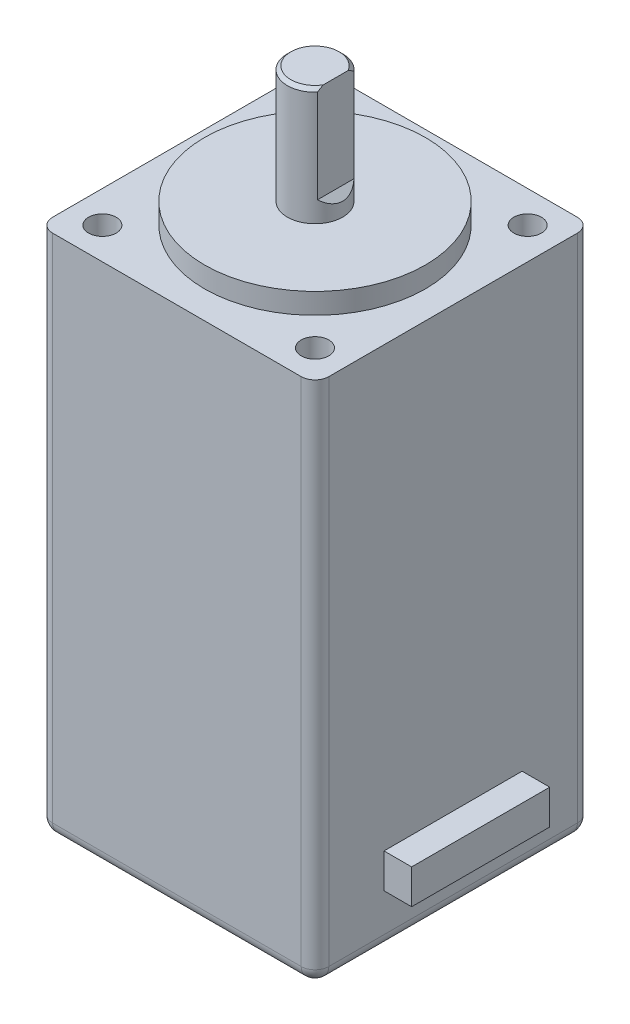
ISO-10303-21;
HEADER;
FILE_DESCRIPTION(('STEP AP214'),'2;1');
FILE_NAME('part.step','',(''),(''),'','','');
FILE_SCHEMA(('AUTOMOTIVE_DESIGN { 1 0 10303 214 1 1 1 1 }'));
ENDSEC;
DATA;
#1=APPLICATION_CONTEXT('core data for automotive mechanical design processes');
#2=APPLICATION_PROTOCOL_DEFINITION('international standard','automotive_design',2000,#1);
#3=PRODUCT_CONTEXT('',#1,'mechanical');
#4=PRODUCT('Part','Part','',(#3));
#5=PRODUCT_RELATED_PRODUCT_CATEGORY('part','',(#4));
#6=PRODUCT_DEFINITION_FORMATION('','',#4);
#7=PRODUCT_DEFINITION_CONTEXT('part definition',#1,'design');
#8=PRODUCT_DEFINITION('design','',#6,#7);
#9=PRODUCT_DEFINITION_SHAPE('','',#8);
#10=(LENGTH_UNIT() NAMED_UNIT(*) SI_UNIT(.MILLI.,.METRE.));
#11=(NAMED_UNIT(*) PLANE_ANGLE_UNIT() SI_UNIT($,.RADIAN.));
#12=(NAMED_UNIT(*) SI_UNIT($,.STERADIAN.) SOLID_ANGLE_UNIT());
#13=UNCERTAINTY_MEASURE_WITH_UNIT(LENGTH_MEASURE(1.E-05),#10,'distance_accuracy_value','');
#14=(GEOMETRIC_REPRESENTATION_CONTEXT(3) GLOBAL_UNCERTAINTY_ASSIGNED_CONTEXT((#13)) GLOBAL_UNIT_ASSIGNED_CONTEXT((#10,
#11,#12)) REPRESENTATION_CONTEXT('',''));
#15=CARTESIAN_POINT('',(0.,0.,0.));
#16=DIRECTION('',(0.,0.,1.));
#17=DIRECTION('',(1.,0.,0.));
#18=AXIS2_PLACEMENT_3D('',#15,#16,#17);
#19=CARTESIAN_POINT('',(9.99999999999998,-38.,9.99999999999995));
#20=DIRECTION('',(1.,0.,0.));
#21=DIRECTION('',(0.,0.,-1.));
#22=AXIS2_PLACEMENT_3D('',#19,#20,#21);
#23=PLANE('',#22);
#24=DIRECTION('',(0.,0.,-1.));
#25=VECTOR('',#24,1.);
#26=CARTESIAN_POINT('',(10.,-37.,-10.));
#27=LINE('',#26,#25);
#28=CARTESIAN_POINT('',(9.99999999999999,-37.,8.99999999999995));
#29=VERTEX_POINT('',#28);
#30=CARTESIAN_POINT('',(10.,-37.,-9.00000000000001));
#31=VERTEX_POINT('',#30);
#32=EDGE_CURVE('E747',#29,#31,#27,.T.);
#33=ORIENTED_EDGE('',*,*,#32,.T.);
#34=DIRECTION('',(0.,1.,0.));
#35=VECTOR('',#34,1.);
#36=CARTESIAN_POINT('',(10.,-38.,-9.00000000000001));
#37=LINE('',#36,#35);
#38=CARTESIAN_POINT('',(10.,0.,-9.00000000000001));
#39=VERTEX_POINT('',#38);
#40=EDGE_CURVE('E749',#31,#39,#37,.T.);
#41=ORIENTED_EDGE('',*,*,#40,.T.);
#42=DIRECTION('',(0.,0.,-1.));
#43=VECTOR('',#42,1.);
#44=CARTESIAN_POINT('',(9.99999999999998,0.,9.99999999999995));
#45=LINE('',#44,#43);
#46=CARTESIAN_POINT('',(9.99999999999999,0.,8.99999999999995));
#47=VERTEX_POINT('',#46);
#48=EDGE_CURVE('E236',#47,#39,#45,.T.);
#49=ORIENTED_EDGE('',*,*,#48,.F.);
#50=DIRECTION('',(0.,1.,0.));
#51=VECTOR('',#50,1.);
#52=CARTESIAN_POINT('',(9.99999999999999,-38.,8.99999999999995));
#53=LINE('',#52,#51);
#54=EDGE_CURVE('E745',#47,#29,#53,.F.);
#55=ORIENTED_EDGE('',*,*,#54,.T.);
#56=EDGE_LOOP('',(#33,#41,#49,#55));
#57=FACE_BOUND('',#56,.T.);
#58=DIRECTION('',(0.,0.,1.));
#59=VECTOR('',#58,1.);
#60=CARTESIAN_POINT('',(9.99999999999998,-34.25,9.99999999999995));
#61=LINE('',#60,#59);
#62=CARTESIAN_POINT('',(10.,-34.25,-5.));
#63=VERTEX_POINT('',#62);
#64=CARTESIAN_POINT('',(10.,-34.25,5.));
#65=VERTEX_POINT('',#64);
#66=EDGE_CURVE('E45',#63,#65,#61,.T.);
#67=ORIENTED_EDGE('',*,*,#66,.T.);
#68=DIRECTION('',(0.,1.,0.));
#69=VECTOR('',#68,1.);
#70=CARTESIAN_POINT('',(10.,-38.,5.));
#71=LINE('',#70,#69);
#72=CARTESIAN_POINT('',(10.,-31.75,5.));
#73=VERTEX_POINT('',#72);
#74=EDGE_CURVE('E12',#65,#73,#71,.T.);
#75=ORIENTED_EDGE('',*,*,#74,.T.);
#76=DIRECTION('',(0.,0.,-1.));
#77=VECTOR('',#76,1.);
#78=CARTESIAN_POINT('',(9.99999999999998,-31.75,9.99999999999995));
#79=LINE('',#78,#77);
#80=CARTESIAN_POINT('',(10.,-31.75,-5.));
#81=VERTEX_POINT('',#80);
#82=EDGE_CURVE('E372',#73,#81,#79,.T.);
#83=ORIENTED_EDGE('',*,*,#82,.T.);
#84=DIRECTION('',(0.,-1.,0.));
#85=VECTOR('',#84,1.);
#86=CARTESIAN_POINT('',(10.,-38.,-5.));
#87=LINE('',#86,#85);
#88=EDGE_CURVE('E161',#81,#63,#87,.T.);
#89=ORIENTED_EDGE('',*,*,#88,.T.);
#90=EDGE_LOOP('',(#67,#75,#83,#89));
#91=FACE_BOUND('',#90,.T.);
#92=ADVANCED_FACE('F37',(#57,#91),#23,.T.);
#93=CARTESIAN_POINT('',(-9.99999999999998,-38.,9.99999999999995));
#94=DIRECTION('',(-1.,0.,0.));
#95=DIRECTION('',(0.,0.,1.));
#96=AXIS2_PLACEMENT_3D('',#93,#94,#95);
#97=PLANE('',#96);
#98=DIRECTION('',(0.,0.,1.));
#99=VECTOR('',#98,1.);
#100=CARTESIAN_POINT('',(-9.99999999999998,0.,9.99999999999995));
#101=LINE('',#100,#99);
#102=CARTESIAN_POINT('',(-9.99999999999996,0.,-9.00000000000001));
#103=VERTEX_POINT('',#102);
#104=CARTESIAN_POINT('',(-9.99999999999998,0.,8.99999999999995));
#105=VERTEX_POINT('',#104);
#106=EDGE_CURVE('E228',#103,#105,#101,.T.);
#107=ORIENTED_EDGE('',*,*,#106,.F.);
#108=DIRECTION('',(0.,1.,0.));
#109=VECTOR('',#108,1.);
#110=CARTESIAN_POINT('',(-9.99999999999996,-38.,-9.00000000000001));
#111=LINE('',#110,#109);
#112=CARTESIAN_POINT('',(-9.99999999999996,-37.,-9.00000000000001));
#113=VERTEX_POINT('',#112);
#114=EDGE_CURVE('E60',#103,#113,#111,.F.);
#115=ORIENTED_EDGE('',*,*,#114,.T.);
#116=DIRECTION('',(0.,0.,1.));
#117=VECTOR('',#116,1.);
#118=CARTESIAN_POINT('',(-9.99999999999998,-37.,9.99999999999995));
#119=LINE('',#118,#117);
#120=CARTESIAN_POINT('',(-9.99999999999998,-37.,8.99999999999995));
#121=VERTEX_POINT('',#120);
#122=EDGE_CURVE('E362',#113,#121,#119,.T.);
#123=ORIENTED_EDGE('',*,*,#122,.T.);
#124=DIRECTION('',(0.,1.,0.));
#125=VECTOR('',#124,1.);
#126=CARTESIAN_POINT('',(-9.99999999999998,-38.,8.99999999999995));
#127=LINE('',#126,#125);
#128=EDGE_CURVE('E351',#121,#105,#127,.T.);
#129=ORIENTED_EDGE('',*,*,#128,.T.);
#130=EDGE_LOOP('',(#107,#115,#123,#129));
#131=FACE_BOUND('',#130,.T.);
#132=ADVANCED_FACE('F340',(#131),#97,.T.);
#133=CARTESIAN_POINT('',(10.,-38.,-10.));
#134=DIRECTION('',(0.,0.,-1.));
#135=DIRECTION('',(-1.,0.,0.));
#136=AXIS2_PLACEMENT_3D('',#133,#134,#135);
#137=PLANE('',#136);
#138=DIRECTION('',(-1.,0.,0.));
#139=VECTOR('',#138,1.);
#140=CARTESIAN_POINT('',(-9.99999999999995,-37.,-10.));
#141=LINE('',#140,#139);
#142=CARTESIAN_POINT('',(9.00000000000003,-37.,-10.));
#143=VERTEX_POINT('',#142);
#144=CARTESIAN_POINT('',(-8.99999999999995,-37.,-10.));
#145=VERTEX_POINT('',#144);
#146=EDGE_CURVE('E753',#143,#145,#141,.T.);
#147=ORIENTED_EDGE('',*,*,#146,.T.);
#148=DIRECTION('',(0.,1.,0.));
#149=VECTOR('',#148,1.);
#150=CARTESIAN_POINT('',(-8.99999999999995,-38.,-10.));
#151=LINE('',#150,#149);
#152=CARTESIAN_POINT('',(-8.99999999999995,0.,-10.));
#153=VERTEX_POINT('',#152);
#154=EDGE_CURVE('E755',#145,#153,#151,.T.);
#155=ORIENTED_EDGE('',*,*,#154,.T.);
#156=DIRECTION('',(-1.,0.,0.));
#157=VECTOR('',#156,1.);
#158=CARTESIAN_POINT('',(10.,0.,-10.));
#159=LINE('',#158,#157);
#160=CARTESIAN_POINT('',(9.00000000000003,0.,-10.));
#161=VERTEX_POINT('',#160);
#162=EDGE_CURVE('E239',#161,#153,#159,.T.);
#163=ORIENTED_EDGE('',*,*,#162,.F.);
#164=DIRECTION('',(0.,1.,0.));
#165=VECTOR('',#164,1.);
#166=CARTESIAN_POINT('',(9.00000000000003,-38.,-10.));
#167=LINE('',#166,#165);
#168=EDGE_CURVE('E751',#161,#143,#167,.F.);
#169=ORIENTED_EDGE('',*,*,#168,.T.);
#170=EDGE_LOOP('',(#147,#155,#163,#169));
#171=FACE_BOUND('',#170,.T.);
#172=ADVANCED_FACE('F337',(#171),#137,.T.);
#173=CARTESIAN_POINT('',(9.99999999999998,-38.,9.99999999999995));
#174=DIRECTION('',(0.,0.,1.));
#175=DIRECTION('',(1.,0.,0.));
#176=AXIS2_PLACEMENT_3D('',#173,#174,#175);
#177=PLANE('',#176);
#178=DIRECTION('',(1.,0.,0.));
#179=VECTOR('',#178,1.);
#180=CARTESIAN_POINT('',(9.99999999999998,-37.,9.99999999999995));
#181=LINE('',#180,#179);
#182=CARTESIAN_POINT('',(-8.99999999999998,-37.,9.99999999999995));
#183=VERTEX_POINT('',#182);
#184=CARTESIAN_POINT('',(8.99999999999999,-37.,9.99999999999995));
#185=VERTEX_POINT('',#184);
#186=EDGE_CURVE('E729',#183,#185,#181,.T.);
#187=ORIENTED_EDGE('',*,*,#186,.T.);
#188=DIRECTION('',(0.,1.,0.));
#189=VECTOR('',#188,1.);
#190=CARTESIAN_POINT('',(8.99999999999999,-38.,9.99999999999995));
#191=LINE('',#190,#189);
#192=CARTESIAN_POINT('',(8.99999999999999,0.,9.99999999999995));
#193=VERTEX_POINT('',#192);
#194=EDGE_CURVE('E734',#185,#193,#191,.T.);
#195=ORIENTED_EDGE('',*,*,#194,.T.);
#196=DIRECTION('',(1.,0.,0.));
#197=VECTOR('',#196,1.);
#198=CARTESIAN_POINT('',(9.99999999999998,0.,9.99999999999995));
#199=LINE('',#198,#197);
#200=CARTESIAN_POINT('',(-8.99999999999998,0.,9.99999999999995));
#201=VERTEX_POINT('',#200);
#202=EDGE_CURVE('E233',#201,#193,#199,.T.);
#203=ORIENTED_EDGE('',*,*,#202,.F.);
#204=DIRECTION('',(0.,1.,0.));
#205=VECTOR('',#204,1.);
#206=CARTESIAN_POINT('',(-8.99999999999998,-38.,9.99999999999995));
#207=LINE('',#206,#205);
#208=EDGE_CURVE('E728',#201,#183,#207,.F.);
#209=ORIENTED_EDGE('',*,*,#208,.T.);
#210=EDGE_LOOP('',(#187,#195,#203,#209));
#211=FACE_BOUND('',#210,.T.);
#212=ADVANCED_FACE('F332',(#211),#177,.T.);
#213=CARTESIAN_POINT('',(0.,-38.,0.));
#214=DIRECTION('',(0.,1.,0.));
#215=DIRECTION('',(0.,0.,1.));
#216=AXIS2_PLACEMENT_3D('',#213,#214,#215);
#217=PLANE('',#216);
#218=DIRECTION('',(0.,0.,-1.));
#219=VECTOR('',#218,1.);
#220=CARTESIAN_POINT('',(8.99999999999998,-38.,9.99999999999995));
#221=LINE('',#220,#219);
#222=CARTESIAN_POINT('',(9.00000000000003,-38.,-9.00000000000001));
#223=VERTEX_POINT('',#222);
#224=CARTESIAN_POINT('',(8.99999999999999,-38.,8.99999999999995));
#225=VERTEX_POINT('',#224);
#226=EDGE_CURVE('E740',#223,#225,#221,.F.);
#227=ORIENTED_EDGE('',*,*,#226,.T.);
#228=DIRECTION('',(1.,0.,0.));
#229=VECTOR('',#228,1.);
#230=CARTESIAN_POINT('',(-9.99999999999998,-38.,8.99999999999995));
#231=LINE('',#230,#229);
#232=CARTESIAN_POINT('',(-8.99999999999998,-38.,8.99999999999995));
#233=VERTEX_POINT('',#232);
#234=EDGE_CURVE('E742',#225,#233,#231,.F.);
#235=ORIENTED_EDGE('',*,*,#234,.T.);
#236=DIRECTION('',(0.,0.,1.));
#237=VECTOR('',#236,1.);
#238=CARTESIAN_POINT('',(-8.99999999999995,-38.,-10.));
#239=LINE('',#238,#237);
#240=CARTESIAN_POINT('',(-8.99999999999995,-38.,-9.00000000000001));
#241=VERTEX_POINT('',#240);
#242=EDGE_CURVE('E736',#233,#241,#239,.F.);
#243=ORIENTED_EDGE('',*,*,#242,.T.);
#244=DIRECTION('',(-1.,0.,0.));
#245=VECTOR('',#244,1.);
#246=CARTESIAN_POINT('',(10.,-38.,-9.00000000000001));
#247=LINE('',#246,#245);
#248=EDGE_CURVE('E738',#241,#223,#247,.F.);
#249=ORIENTED_EDGE('',*,*,#248,.T.);
#250=EDGE_LOOP('',(#227,#235,#243,#249));
#251=FACE_BOUND('',#250,.T.);
#252=ADVANCED_FACE('F329',(#251),#217,.F.);
#253=CARTESIAN_POINT('',(0.,0.,0.));
#254=DIRECTION('',(0.,1.,0.));
#255=DIRECTION('',(0.,0.,1.));
#256=AXIS2_PLACEMENT_3D('',#253,#254,#255);
#257=PLANE('',#256);
#258=CARTESIAN_POINT('',(0.,0.,0.));
#259=DIRECTION('',(0.,1.,0.));
#260=DIRECTION('',(0.,0.,1.));
#261=AXIS2_PLACEMENT_3D('',#258,#259,#260);
#262=CIRCLE('',#261,8.);
#263=CARTESIAN_POINT('',(0.,0.,8.));
#264=VERTEX_POINT('',#263);
#265=EDGE_CURVE('E204',#264,#264,#262,.T.);
#266=ORIENTED_EDGE('',*,*,#265,.F.);
#267=EDGE_LOOP('',(#266));
#268=FACE_BOUND('',#267,.T.);
#269=CARTESIAN_POINT('',(-7.7,0.,7.7));
#270=DIRECTION('',(0.,1.,0.));
#271=DIRECTION('',(0.,0.,1.));
#272=AXIS2_PLACEMENT_3D('',#269,#270,#271);
#273=CIRCLE('',#272,1.);
#274=CARTESIAN_POINT('',(-7.7,0.,8.7));
#275=VERTEX_POINT('',#274);
#276=EDGE_CURVE('E203',#275,#275,#273,.T.);
#277=ORIENTED_EDGE('',*,*,#276,.F.);
#278=EDGE_LOOP('',(#277));
#279=FACE_BOUND('',#278,.T.);
#280=CARTESIAN_POINT('',(7.7,0.,7.7));
#281=DIRECTION('',(0.,1.,0.));
#282=DIRECTION('',(0.,0.,1.));
#283=AXIS2_PLACEMENT_3D('',#280,#281,#282);
#284=CIRCLE('',#283,1.);
#285=CARTESIAN_POINT('',(7.7,0.,8.7));
#286=VERTEX_POINT('',#285);
#287=EDGE_CURVE('E217',#286,#286,#284,.T.);
#288=ORIENTED_EDGE('',*,*,#287,.F.);
#289=EDGE_LOOP('',(#288));
#290=FACE_BOUND('',#289,.T.);
#291=CARTESIAN_POINT('',(7.7,0.,-7.7));
#292=DIRECTION('',(0.,1.,0.));
#293=DIRECTION('',(0.,0.,1.));
#294=AXIS2_PLACEMENT_3D('',#291,#292,#293);
#295=CIRCLE('',#294,0.999999999999999);
#296=CARTESIAN_POINT('',(7.7,0.,-6.7));
#297=VERTEX_POINT('',#296);
#298=EDGE_CURVE('E211',#297,#297,#295,.T.);
#299=ORIENTED_EDGE('',*,*,#298,.F.);
#300=EDGE_LOOP('',(#299));
#301=FACE_BOUND('',#300,.T.);
#302=CARTESIAN_POINT('',(-7.7,0.,-7.7));
#303=DIRECTION('',(0.,1.,0.));
#304=DIRECTION('',(0.,0.,1.));
#305=AXIS2_PLACEMENT_3D('',#302,#303,#304);
#306=CIRCLE('',#305,1.);
#307=CARTESIAN_POINT('',(-7.7,0.,-6.7));
#308=VERTEX_POINT('',#307);
#309=EDGE_CURVE('E210',#308,#308,#306,.T.);
#310=ORIENTED_EDGE('',*,*,#309,.F.);
#311=EDGE_LOOP('',(#310));
#312=FACE_BOUND('',#311,.T.);
#313=ORIENTED_EDGE('',*,*,#162,.T.);
#314=CARTESIAN_POINT('',(-8.99999999999995,0.,-9.00000000000001));
#315=DIRECTION('',(0.,1.,0.));
#316=DIRECTION('',(0.,0.,1.));
#317=AXIS2_PLACEMENT_3D('',#314,#315,#316);
#318=CIRCLE('',#317,1.);
#319=EDGE_CURVE('E357',#153,#103,#318,.T.);
#320=ORIENTED_EDGE('',*,*,#319,.T.);
#321=ORIENTED_EDGE('',*,*,#106,.T.);
#322=CARTESIAN_POINT('',(-8.99999999999998,0.,8.99999999999995));
#323=DIRECTION('',(0.,1.,0.));
#324=DIRECTION('',(0.,0.,1.));
#325=AXIS2_PLACEMENT_3D('',#322,#323,#324);
#326=CIRCLE('',#325,1.);
#327=EDGE_CURVE('E361',#105,#201,#326,.T.);
#328=ORIENTED_EDGE('',*,*,#327,.T.);
#329=ORIENTED_EDGE('',*,*,#202,.T.);
#330=CARTESIAN_POINT('',(8.99999999999999,0.,8.99999999999995));
#331=DIRECTION('',(0.,1.,0.));
#332=DIRECTION('',(0.,0.,1.));
#333=AXIS2_PLACEMENT_3D('',#330,#331,#332);
#334=CIRCLE('',#333,1.);
#335=EDGE_CURVE('E364',#193,#47,#334,.T.);
#336=ORIENTED_EDGE('',*,*,#335,.T.);
#337=ORIENTED_EDGE('',*,*,#48,.T.);
#338=CARTESIAN_POINT('',(9.00000000000003,0.,-9.00000000000001));
#339=DIRECTION('',(0.,1.,0.));
#340=DIRECTION('',(0.,0.,1.));
#341=AXIS2_PLACEMENT_3D('',#338,#339,#340);
#342=CIRCLE('',#341,1.);
#343=EDGE_CURVE('E370',#39,#161,#342,.T.);
#344=ORIENTED_EDGE('',*,*,#343,.T.);
#345=EDGE_LOOP('',(#313,#320,#321,#328,#329,#336,#337,#344));
#346=FACE_BOUND('',#345,.T.);
#347=ADVANCED_FACE('F327',(#268,#279,#290,#301,#312,#346),#257,.T.);
#348=CARTESIAN_POINT('',(-7.7,-2.5,-7.7));
#349=DIRECTION('',(0.,1.,0.));
#350=DIRECTION('',(0.,0.,1.));
#351=AXIS2_PLACEMENT_3D('',#348,#349,#350);
#352=CYLINDRICAL_SURFACE('',#351,1.);
#353=CARTESIAN_POINT('',(-7.7,-2.5,-7.7));
#354=DIRECTION('',(0.,1.,0.));
#355=DIRECTION('',(0.,0.,1.));
#356=AXIS2_PLACEMENT_3D('',#353,#354,#355);
#357=CIRCLE('',#356,1.);
#358=CARTESIAN_POINT('',(-7.7,-2.5,-6.7));
#359=VERTEX_POINT('',#358);
#360=EDGE_CURVE('E225',#359,#359,#357,.T.);
#361=ORIENTED_EDGE('',*,*,#360,.F.);
#362=EDGE_LOOP('',(#361));
#363=FACE_BOUND('',#362,.T.);
#364=ORIENTED_EDGE('',*,*,#309,.T.);
#365=EDGE_LOOP('',(#364));
#366=FACE_BOUND('',#365,.T.);
#367=ADVANCED_FACE('F323',(#363,#366),#352,.F.);
#368=CARTESIAN_POINT('',(-7.7,-2.5,-7.7));
#369=DIRECTION('',(0.,1.,0.));
#370=DIRECTION('',(0.,0.,1.));
#371=AXIS2_PLACEMENT_3D('',#368,#369,#370);
#372=PLANE('',#371);
#373=ORIENTED_EDGE('',*,*,#360,.T.);
#374=EDGE_LOOP('',(#373));
#375=FACE_BOUND('',#374,.T.);
#376=ADVANCED_FACE('F305',(#375),#372,.T.);
#377=CARTESIAN_POINT('',(7.7,-2.5,-7.7));
#378=DIRECTION('',(0.,1.,0.));
#379=DIRECTION('',(0.,0.,1.));
#380=AXIS2_PLACEMENT_3D('',#377,#378,#379);
#381=CYLINDRICAL_SURFACE('',#380,0.999999999999999);
#382=CARTESIAN_POINT('',(7.7,-2.5,-7.7));
#383=DIRECTION('',(0.,1.,0.));
#384=DIRECTION('',(0.,0.,1.));
#385=AXIS2_PLACEMENT_3D('',#382,#383,#384);
#386=CIRCLE('',#385,0.999999999999999);
#387=CARTESIAN_POINT('',(7.7,-2.5,-6.7));
#388=VERTEX_POINT('',#387);
#389=EDGE_CURVE('E207',#388,#388,#386,.T.);
#390=ORIENTED_EDGE('',*,*,#389,.F.);
#391=EDGE_LOOP('',(#390));
#392=FACE_BOUND('',#391,.T.);
#393=ORIENTED_EDGE('',*,*,#298,.T.);
#394=EDGE_LOOP('',(#393));
#395=FACE_BOUND('',#394,.T.);
#396=ADVANCED_FACE('F301',(#392,#395),#381,.F.);
#397=CARTESIAN_POINT('',(7.7,-2.5,-7.7));
#398=DIRECTION('',(0.,1.,0.));
#399=DIRECTION('',(0.,0.,1.));
#400=AXIS2_PLACEMENT_3D('',#397,#398,#399);
#401=PLANE('',#400);
#402=ORIENTED_EDGE('',*,*,#389,.T.);
#403=EDGE_LOOP('',(#402));
#404=FACE_BOUND('',#403,.T.);
#405=ADVANCED_FACE('F297',(#404),#401,.T.);
#406=CARTESIAN_POINT('',(7.7,-2.5,7.7));
#407=DIRECTION('',(0.,1.,0.));
#408=DIRECTION('',(0.,0.,1.));
#409=AXIS2_PLACEMENT_3D('',#406,#407,#408);
#410=CYLINDRICAL_SURFACE('',#409,1.);
#411=CARTESIAN_POINT('',(7.7,-2.5,7.7));
#412=DIRECTION('',(0.,1.,0.));
#413=DIRECTION('',(0.,0.,1.));
#414=AXIS2_PLACEMENT_3D('',#411,#412,#413);
#415=CIRCLE('',#414,1.);
#416=CARTESIAN_POINT('',(7.7,-2.5,8.7));
#417=VERTEX_POINT('',#416);
#418=EDGE_CURVE('E214',#417,#417,#415,.T.);
#419=ORIENTED_EDGE('',*,*,#418,.F.);
#420=EDGE_LOOP('',(#419));
#421=FACE_BOUND('',#420,.T.);
#422=ORIENTED_EDGE('',*,*,#287,.T.);
#423=EDGE_LOOP('',(#422));
#424=FACE_BOUND('',#423,.T.);
#425=ADVANCED_FACE('F300',(#421,#424),#410,.F.);
#426=CARTESIAN_POINT('',(7.7,-2.5,7.7));
#427=DIRECTION('',(0.,1.,0.));
#428=DIRECTION('',(0.,0.,1.));
#429=AXIS2_PLACEMENT_3D('',#426,#427,#428);
#430=PLANE('',#429);
#431=ORIENTED_EDGE('',*,*,#418,.T.);
#432=EDGE_LOOP('',(#431));
#433=FACE_BOUND('',#432,.T.);
#434=ADVANCED_FACE('F307',(#433),#430,.T.);
#435=CARTESIAN_POINT('',(-7.7,-2.5,7.7));
#436=DIRECTION('',(0.,1.,0.));
#437=DIRECTION('',(0.,0.,1.));
#438=AXIS2_PLACEMENT_3D('',#435,#436,#437);
#439=CYLINDRICAL_SURFACE('',#438,1.);
#440=CARTESIAN_POINT('',(-7.7,-2.5,7.7));
#441=DIRECTION('',(0.,1.,0.));
#442=DIRECTION('',(0.,0.,1.));
#443=AXIS2_PLACEMENT_3D('',#440,#441,#442);
#444=CIRCLE('',#443,1.);
#445=CARTESIAN_POINT('',(-7.7,-2.5,8.7));
#446=VERTEX_POINT('',#445);
#447=EDGE_CURVE('E220',#446,#446,#444,.T.);
#448=ORIENTED_EDGE('',*,*,#447,.F.);
#449=EDGE_LOOP('',(#448));
#450=FACE_BOUND('',#449,.T.);
#451=ORIENTED_EDGE('',*,*,#276,.T.);
#452=EDGE_LOOP('',(#451));
#453=FACE_BOUND('',#452,.T.);
#454=ADVANCED_FACE('F310',(#450,#453),#439,.F.);
#455=CARTESIAN_POINT('',(-7.7,-2.5,7.7));
#456=DIRECTION('',(0.,1.,0.));
#457=DIRECTION('',(0.,0.,1.));
#458=AXIS2_PLACEMENT_3D('',#455,#456,#457);
#459=PLANE('',#458);
#460=ORIENTED_EDGE('',*,*,#447,.T.);
#461=EDGE_LOOP('',(#460));
#462=FACE_BOUND('',#461,.T.);
#463=ADVANCED_FACE('F295',(#462),#459,.T.);
#464=CARTESIAN_POINT('',(0.,1.5,0.));
#465=DIRECTION('',(0.,-1.,0.));
#466=DIRECTION('',(0.,0.,-1.));
#467=AXIS2_PLACEMENT_3D('',#464,#465,#466);
#468=CYLINDRICAL_SURFACE('',#467,8.);
#469=CARTESIAN_POINT('',(0.,1.5,0.));
#470=DIRECTION('',(0.,1.,0.));
#471=DIRECTION('',(0.,0.,1.));
#472=AXIS2_PLACEMENT_3D('',#469,#470,#471);
#473=CIRCLE('',#472,8.);
#474=CARTESIAN_POINT('',(0.,1.5,8.));
#475=VERTEX_POINT('',#474);
#476=EDGE_CURVE('E200',#475,#475,#473,.T.);
#477=ORIENTED_EDGE('',*,*,#476,.F.);
#478=EDGE_LOOP('',(#477));
#479=FACE_BOUND('',#478,.T.);
#480=ORIENTED_EDGE('',*,*,#265,.T.);
#481=EDGE_LOOP('',(#480));
#482=FACE_BOUND('',#481,.T.);
#483=ADVANCED_FACE('F291',(#479,#482),#468,.T.);
#484=CARTESIAN_POINT('',(0.,1.5,0.));
#485=DIRECTION('',(0.,1.,0.));
#486=DIRECTION('',(0.,0.,1.));
#487=AXIS2_PLACEMENT_3D('',#484,#485,#486);
#488=PLANE('',#487);
#489=CARTESIAN_POINT('',(0.,1.5,0.));
#490=DIRECTION('',(0.,1.,0.));
#491=DIRECTION('',(0.,0.,1.));
#492=AXIS2_PLACEMENT_3D('',#489,#490,#491);
#493=CIRCLE('',#492,2.);
#494=CARTESIAN_POINT('',(0.,1.5,2.));
#495=VERTEX_POINT('',#494);
#496=EDGE_CURVE('E199',#495,#495,#493,.F.);
#497=ORIENTED_EDGE('',*,*,#496,.T.);
#498=EDGE_LOOP('',(#497));
#499=FACE_BOUND('',#498,.T.);
#500=ORIENTED_EDGE('',*,*,#476,.T.);
#501=EDGE_LOOP('',(#500));
#502=FACE_BOUND('',#501,.T.);
#503=ADVANCED_FACE('F287',(#499,#502),#488,.T.);
#504=CARTESIAN_POINT('',(0.,10.,0.));
#505=DIRECTION('',(0.,-1.,0.));
#506=DIRECTION('',(0.,0.,-1.));
#507=AXIS2_PLACEMENT_3D('',#504,#505,#506);
#508=CYLINDRICAL_SURFACE('',#507,2.);
#509=ORIENTED_EDGE('',*,*,#496,.F.);
#510=EDGE_LOOP('',(#509));
#511=FACE_BOUND('',#510,.T.);
#512=DIRECTION('',(0.,-1.,0.));
#513=VECTOR('',#512,1.);
#514=CARTESIAN_POINT('',(1.5,10.,1.3228756555323));
#515=LINE('',#514,#513);
#516=CARTESIAN_POINT('',(1.5,3.00000000000001,1.32287565553229));
#517=VERTEX_POINT('',#516);
#518=CARTESIAN_POINT('',(1.5,9.74999999999999,1.3228756555323));
#519=VERTEX_POINT('',#518);
#520=EDGE_CURVE('E193',#517,#519,#515,.F.);
#521=ORIENTED_EDGE('',*,*,#520,.T.);
#522=CARTESIAN_POINT('',(0.,9.74999999999999,0.));
#523=DIRECTION('',(0.,1.,0.));
#524=DIRECTION('',(0.,0.,1.));
#525=AXIS2_PLACEMENT_3D('',#522,#523,#524);
#526=CIRCLE('',#525,2.);
#527=CARTESIAN_POINT('',(1.5,9.74999999999999,-1.3228756555323));
#528=VERTEX_POINT('',#527);
#529=EDGE_CURVE('E726',#519,#528,#526,.F.);
#530=ORIENTED_EDGE('',*,*,#529,.T.);
#531=DIRECTION('',(0.,-1.,0.));
#532=VECTOR('',#531,1.);
#533=CARTESIAN_POINT('',(1.5,10.,-1.3228756555323));
#534=LINE('',#533,#532);
#535=CARTESIAN_POINT('',(1.5,3.00000000000001,-1.32287565553229));
#536=VERTEX_POINT('',#535);
#537=EDGE_CURVE('E197',#528,#536,#534,.T.);
#538=ORIENTED_EDGE('',*,*,#537,.T.);
#539=CARTESIAN_POINT('',(0.,4.50000000000002,0.));
#540=DIRECTION('',(-0.707106781186552,-0.707106781186544,0.));
#541=DIRECTION('',(0.707106781186544,-0.707106781186552,0.));
#542=AXIS2_PLACEMENT_3D('',#539,#540,#541);
#543=ELLIPSE('',#542,2.82842712474621,2.);
#544=EDGE_CURVE('E247',#536,#517,#543,.T.);
#545=ORIENTED_EDGE('',*,*,#544,.T.);
#546=EDGE_LOOP('',(#521,#530,#538,#545));
#547=FACE_BOUND('',#546,.T.);
#548=ADVANCED_FACE('F283',(#511,#547),#508,.T.);
#549=CARTESIAN_POINT('',(0.,10.,0.));
#550=DIRECTION('',(0.,1.,0.));
#551=DIRECTION('',(0.,0.,1.));
#552=AXIS2_PLACEMENT_3D('',#549,#550,#551);
#553=PLANE('',#552);
#554=DIRECTION('',(0.,0.,1.));
#555=VECTOR('',#554,1.);
#556=CARTESIAN_POINT('',(1.5,10.,0.));
#557=LINE('',#556,#555);
#558=CARTESIAN_POINT('',(1.5,10.,-0.901387818865987));
#559=VERTEX_POINT('',#558);
#560=CARTESIAN_POINT('',(1.5,10.,0.901387818865987));
#561=VERTEX_POINT('',#560);
#562=EDGE_CURVE('E242',#559,#561,#557,.T.);
#563=ORIENTED_EDGE('',*,*,#562,.F.);
#564=CARTESIAN_POINT('',(0.,10.,0.));
#565=DIRECTION('',(0.,1.,0.));
#566=DIRECTION('',(0.,0.,1.));
#567=AXIS2_PLACEMENT_3D('',#564,#565,#566);
#568=CIRCLE('',#567,1.74999999999999);
#569=EDGE_CURVE('E250',#559,#561,#568,.T.);
#570=ORIENTED_EDGE('',*,*,#569,.T.);
#571=EDGE_LOOP('',(#563,#570));
#572=FACE_BOUND('',#571,.T.);
#573=ADVANCED_FACE('F279',(#572),#553,.T.);
#574=CARTESIAN_POINT('',(1.5,3.00000000000001,-10.));
#575=DIRECTION('',(-0.707106781186552,-0.707106781186544,0.));
#576=DIRECTION('',(0.707106781186544,-0.707106781186552,0.));
#577=AXIS2_PLACEMENT_3D('',#574,#575,#576);
#578=PLANE('',#577);
#579=ORIENTED_EDGE('',*,*,#544,.F.);
#580=DIRECTION('',(0.,0.,1.));
#581=VECTOR('',#580,1.);
#582=CARTESIAN_POINT('',(1.5,3.00000000000001,-10.));
#583=LINE('',#582,#581);
#584=EDGE_CURVE('E190',#536,#517,#583,.T.);
#585=ORIENTED_EDGE('',*,*,#584,.T.);
#586=EDGE_LOOP('',(#579,#585));
#587=FACE_BOUND('',#586,.T.);
#588=ADVANCED_FACE('F276',(#587),#578,.F.);
#589=CARTESIAN_POINT('',(1.5,10.,-10.));
#590=DIRECTION('',(-1.,0.,0.));
#591=DIRECTION('',(0.,-1.,0.));
#592=AXIS2_PLACEMENT_3D('',#589,#590,#591);
#593=PLANE('',#592);
#594=ORIENTED_EDGE('',*,*,#562,.T.);
#595=CARTESIAN_POINT('',(1.5,10.,0.901387818865987));
#596=CARTESIAN_POINT('',(1.5,9.981276340262,0.937727475490085));
#597=CARTESIAN_POINT('',(1.5,9.9619077042354,0.973727652597342));
#598=CARTESIAN_POINT('',(1.5,9.92207320091962,1.04508241448854));
#599=CARTESIAN_POINT('',(1.5,9.9016081442816,1.0804374510283));
#600=CARTESIAN_POINT('',(1.5,9.85974884820225,1.15058283973808));
#601=CARTESIAN_POINT('',(1.5,9.83835474960909,1.18537327641368));
#602=CARTESIAN_POINT('',(1.5,9.79475188426179,1.25447596056114));
#603=CARTESIAN_POINT('',(1.5,9.77254253498532,1.2887878409447));
#604=CARTESIAN_POINT('',(1.5,9.74999999999999,1.3228756555323));
#605=B_SPLINE_CURVE_WITH_KNOTS('',3,(#595,#596,#597,#598,#599,#600,#601,#602,#603,#604),
.UNSPECIFIED.,.F.,.F.,(4,2,2,2,4),(0.,0.122623332253724,0.245157220205461,0.367672595723056,
0.490277284784278),.UNSPECIFIED.);
#606=EDGE_CURVE('E261',#561,#519,#605,.T.);
#607=ORIENTED_EDGE('',*,*,#606,.T.);
#608=ORIENTED_EDGE('',*,*,#520,.F.);
#609=ORIENTED_EDGE('',*,*,#584,.F.);
#610=ORIENTED_EDGE('',*,*,#537,.F.);
#611=CARTESIAN_POINT('',(1.5,9.74999999999999,-1.3228756555323));
#612=CARTESIAN_POINT('',(1.5,9.77254253498532,-1.2887878409447));
#613=CARTESIAN_POINT('',(1.5,9.79475188426179,-1.25447596056114));
#614=CARTESIAN_POINT('',(1.5,9.83835474960909,-1.18537327641368));
#615=CARTESIAN_POINT('',(1.5,9.85974884820225,-1.15058283973808));
#616=CARTESIAN_POINT('',(1.5,9.9016081442816,-1.0804374510283));
#617=CARTESIAN_POINT('',(1.5,9.92207320091962,-1.04508241448854));
#618=CARTESIAN_POINT('',(1.5,9.9619077042354,-0.973727652597342));
#619=CARTESIAN_POINT('',(1.5,9.981276340262,-0.937727475490085));
#620=CARTESIAN_POINT('',(1.5,10.,-0.901387818865987));
#621=B_SPLINE_CURVE_WITH_KNOTS('',3,(#611,#612,#613,#614,#615,#616,#617,#618,#619,#620),
.UNSPECIFIED.,.F.,.F.,(4,2,2,2,4),(0.,0.122604689061222,0.245120064578817,0.367653952530554,
0.490277284784278),.UNSPECIFIED.);
#622=EDGE_CURVE('E253',#528,#559,#621,.T.);
#623=ORIENTED_EDGE('',*,*,#622,.T.);
#624=EDGE_LOOP('',(#594,#607,#608,#609,#610,#623));
#625=FACE_BOUND('',#624,.T.);
#626=ADVANCED_FACE('F271',(#625),#593,.F.);
#627=CARTESIAN_POINT('',(0.,10.,0.));
#628=DIRECTION('',(0.,-1.,0.));
#629=DIRECTION('',(0.,0.,-1.));
#630=AXIS2_PLACEMENT_3D('',#627,#628,#629);
#631=CONICAL_SURFACE('',#630,1.74999999999999,0.785398163397448);
#632=ORIENTED_EDGE('',*,*,#622,.F.);
#633=ORIENTED_EDGE('',*,*,#529,.F.);
#634=ORIENTED_EDGE('',*,*,#606,.F.);
#635=ORIENTED_EDGE('',*,*,#569,.F.);
#636=EDGE_LOOP('',(#632,#633,#634,#635));
#637=FACE_BOUND('',#636,.T.);
#638=ADVANCED_FACE('F267',(#637),#631,.T.);
#639=CARTESIAN_POINT('',(-8.99999999999995,-38.,-9.00000000000001));
#640=DIRECTION('',(0.,1.,0.));
#641=DIRECTION('',(0.,0.,1.));
#642=AXIS2_PLACEMENT_3D('',#639,#640,#641);
#643=CYLINDRICAL_SURFACE('',#642,1.);
#644=ORIENTED_EDGE('',*,*,#319,.F.);
#645=ORIENTED_EDGE('',*,*,#154,.F.);
#646=CARTESIAN_POINT('',(-8.99999999999996,-37.,-9.00000000000001));
#647=DIRECTION('',(0.,-1.,0.));
#648=DIRECTION('',(0.,0.,-1.));
#649=AXIS2_PLACEMENT_3D('',#646,#647,#648);
#650=CIRCLE('',#649,1.);
#651=EDGE_CURVE('E359',#113,#145,#650,.T.);
#652=ORIENTED_EDGE('',*,*,#651,.F.);
#653=ORIENTED_EDGE('',*,*,#114,.F.);
#654=EDGE_LOOP('',(#644,#645,#652,#653));
#655=FACE_BOUND('',#654,.T.);
#656=ADVANCED_FACE('F39',(#655),#643,.T.);
#657=CARTESIAN_POINT('',(9.00000000000003,-38.,-9.00000000000001));
#658=DIRECTION('',(0.,1.,0.));
#659=DIRECTION('',(0.,0.,1.));
#660=AXIS2_PLACEMENT_3D('',#657,#658,#659);
#661=CYLINDRICAL_SURFACE('',#660,1.);
#662=ORIENTED_EDGE('',*,*,#343,.F.);
#663=ORIENTED_EDGE('',*,*,#40,.F.);
#664=CARTESIAN_POINT('',(9.00000000000003,-37.,-9.00000000000001));
#665=DIRECTION('',(0.,-1.,0.));
#666=DIRECTION('',(0.,0.,-1.));
#667=AXIS2_PLACEMENT_3D('',#664,#665,#666);
#668=CIRCLE('',#667,1.);
#669=EDGE_CURVE('E396',#143,#31,#668,.T.);
#670=ORIENTED_EDGE('',*,*,#669,.F.);
#671=ORIENTED_EDGE('',*,*,#168,.F.);
#672=EDGE_LOOP('',(#662,#663,#670,#671));
#673=FACE_BOUND('',#672,.T.);
#674=ADVANCED_FACE('F551',(#673),#661,.T.);
#675=CARTESIAN_POINT('',(10.,-37.,-9.00000000000001));
#676=DIRECTION('',(1.,0.,0.));
#677=DIRECTION('',(0.,0.,-1.));
#678=AXIS2_PLACEMENT_3D('',#675,#676,#677);
#679=CYLINDRICAL_SURFACE('',#678,1.);
#680=CARTESIAN_POINT('',(-8.99999999999995,-37.,-9.00000000000001));
#681=DIRECTION('',(-1.,0.,0.));
#682=DIRECTION('',(0.,-1.,0.));
#683=AXIS2_PLACEMENT_3D('',#680,#681,#682);
#684=CIRCLE('',#683,1.);
#685=EDGE_CURVE('E194',#145,#241,#684,.T.);
#686=ORIENTED_EDGE('',*,*,#685,.F.);
#687=ORIENTED_EDGE('',*,*,#146,.F.);
#688=CARTESIAN_POINT('',(9.00000000000003,-37.,-9.00000000000001));
#689=DIRECTION('',(1.,0.,0.));
#690=DIRECTION('',(0.,0.,-1.));
#691=AXIS2_PLACEMENT_3D('',#688,#689,#690);
#692=CIRCLE('',#691,1.);
#693=EDGE_CURVE('E393',#223,#143,#692,.T.);
#694=ORIENTED_EDGE('',*,*,#693,.F.);
#695=ORIENTED_EDGE('',*,*,#248,.F.);
#696=EDGE_LOOP('',(#686,#687,#694,#695));
#697=FACE_BOUND('',#696,.T.);
#698=ADVANCED_FACE('F541',(#697),#679,.T.);
#699=CARTESIAN_POINT('',(-8.99999999999995,-37.,-9.00000000000001));
#700=DIRECTION('',(0.,0.,1.));
#701=DIRECTION('',(1.,0.,0.));
#702=AXIS2_PLACEMENT_3D('',#699,#700,#701);
#703=SPHERICAL_SURFACE('',#702,1.);
#704=ORIENTED_EDGE('',*,*,#651,.T.);
#705=ORIENTED_EDGE('',*,*,#685,.T.);
#706=CARTESIAN_POINT('',(-8.99999999999995,-37.,-9.00000000000001));
#707=DIRECTION('',(0.,0.,-1.));
#708=DIRECTION('',(-1.,0.,0.));
#709=AXIS2_PLACEMENT_3D('',#706,#707,#708);
#710=CIRCLE('',#709,1.);
#711=EDGE_CURVE('E390',#113,#241,#710,.F.);
#712=ORIENTED_EDGE('',*,*,#711,.F.);
#713=EDGE_LOOP('',(#704,#705,#712));
#714=FACE_BOUND('',#713,.T.);
#715=ADVANCED_FACE('F531',(#714),#703,.T.);
#716=CARTESIAN_POINT('',(9.00000000000003,-37.,-9.00000000000001));
#717=DIRECTION('',(0.,0.,1.));
#718=DIRECTION('',(1.,0.,0.));
#719=AXIS2_PLACEMENT_3D('',#716,#717,#718);
#720=SPHERICAL_SURFACE('',#719,1.);
#721=ORIENTED_EDGE('',*,*,#693,.T.);
#722=ORIENTED_EDGE('',*,*,#669,.T.);
#723=CARTESIAN_POINT('',(9.00000000000003,-37.,-9.00000000000001));
#724=DIRECTION('',(0.,0.,-1.));
#725=DIRECTION('',(-1.,0.,0.));
#726=AXIS2_PLACEMENT_3D('',#723,#724,#725);
#727=CIRCLE('',#726,1.);
#728=EDGE_CURVE('E387',#223,#31,#727,.F.);
#729=ORIENTED_EDGE('',*,*,#728,.F.);
#730=EDGE_LOOP('',(#721,#722,#729));
#731=FACE_BOUND('',#730,.T.);
#732=ADVANCED_FACE('F521',(#731),#720,.T.);
#733=CARTESIAN_POINT('',(-8.99999999999998,-37.,9.99999999999996));
#734=DIRECTION('',(0.,0.,-1.));
#735=DIRECTION('',(-1.,0.,0.));
#736=AXIS2_PLACEMENT_3D('',#733,#734,#735);
#737=CYLINDRICAL_SURFACE('',#736,1.);
#738=ORIENTED_EDGE('',*,*,#711,.T.);
#739=ORIENTED_EDGE('',*,*,#242,.F.);
#740=CARTESIAN_POINT('',(-8.99999999999998,-37.,8.99999999999995));
#741=DIRECTION('',(0.,0.,1.));
#742=DIRECTION('',(1.,0.,0.));
#743=AXIS2_PLACEMENT_3D('',#740,#741,#742);
#744=CIRCLE('',#743,1.);
#745=EDGE_CURVE('E384',#121,#233,#744,.T.);
#746=ORIENTED_EDGE('',*,*,#745,.F.);
#747=ORIENTED_EDGE('',*,*,#122,.F.);
#748=EDGE_LOOP('',(#738,#739,#746,#747));
#749=FACE_BOUND('',#748,.T.);
#750=ADVANCED_FACE('F511',(#749),#737,.T.);
#751=CARTESIAN_POINT('',(-8.99999999999998,-38.,8.99999999999995));
#752=DIRECTION('',(0.,1.,0.));
#753=DIRECTION('',(0.,0.,1.));
#754=AXIS2_PLACEMENT_3D('',#751,#752,#753);
#755=CYLINDRICAL_SURFACE('',#754,1.);
#756=ORIENTED_EDGE('',*,*,#327,.F.);
#757=ORIENTED_EDGE('',*,*,#128,.F.);
#758=CARTESIAN_POINT('',(-8.99999999999998,-37.,8.99999999999995));
#759=DIRECTION('',(0.,-1.,0.));
#760=DIRECTION('',(0.,0.,-1.));
#761=AXIS2_PLACEMENT_3D('',#758,#759,#760);
#762=CIRCLE('',#761,1.);
#763=EDGE_CURVE('E381',#183,#121,#762,.T.);
#764=ORIENTED_EDGE('',*,*,#763,.F.);
#765=ORIENTED_EDGE('',*,*,#208,.F.);
#766=EDGE_LOOP('',(#756,#757,#764,#765));
#767=FACE_BOUND('',#766,.T.);
#768=ADVANCED_FACE('F501',(#767),#755,.T.);
#769=CARTESIAN_POINT('',(8.99999999999999,-38.,8.99999999999995));
#770=DIRECTION('',(0.,1.,0.));
#771=DIRECTION('',(0.,0.,1.));
#772=AXIS2_PLACEMENT_3D('',#769,#770,#771);
#773=CYLINDRICAL_SURFACE('',#772,1.);
#774=ORIENTED_EDGE('',*,*,#335,.F.);
#775=ORIENTED_EDGE('',*,*,#194,.F.);
#776=CARTESIAN_POINT('',(8.99999999999999,-37.,8.99999999999995));
#777=DIRECTION('',(0.,-1.,0.));
#778=DIRECTION('',(0.,0.,-1.));
#779=AXIS2_PLACEMENT_3D('',#776,#777,#778);
#780=CIRCLE('',#779,1.);
#781=EDGE_CURVE('E378',#29,#185,#780,.T.);
#782=ORIENTED_EDGE('',*,*,#781,.F.);
#783=ORIENTED_EDGE('',*,*,#54,.F.);
#784=EDGE_LOOP('',(#774,#775,#782,#783));
#785=FACE_BOUND('',#784,.T.);
#786=ADVANCED_FACE('F491',(#785),#773,.T.);
#787=CARTESIAN_POINT('',(8.99999999999998,-37.,9.99999999999995));
#788=DIRECTION('',(0.,0.,1.));
#789=DIRECTION('',(1.,0.,0.));
#790=AXIS2_PLACEMENT_3D('',#787,#788,#789);
#791=CYLINDRICAL_SURFACE('',#790,1.);
#792=ORIENTED_EDGE('',*,*,#728,.T.);
#793=ORIENTED_EDGE('',*,*,#32,.F.);
#794=CARTESIAN_POINT('',(8.99999999999999,-37.,8.99999999999995));
#795=DIRECTION('',(0.,0.,1.));
#796=DIRECTION('',(1.,0.,0.));
#797=AXIS2_PLACEMENT_3D('',#794,#795,#796);
#798=CIRCLE('',#797,1.);
#799=EDGE_CURVE('E375',#225,#29,#798,.T.);
#800=ORIENTED_EDGE('',*,*,#799,.F.);
#801=ORIENTED_EDGE('',*,*,#226,.F.);
#802=EDGE_LOOP('',(#792,#793,#800,#801));
#803=FACE_BOUND('',#802,.T.);
#804=ADVANCED_FACE('F481',(#803),#791,.T.);
#805=CARTESIAN_POINT('',(-8.99999999999998,-37.,8.99999999999995));
#806=DIRECTION('',(0.,0.,1.));
#807=DIRECTION('',(1.,0.,0.));
#808=AXIS2_PLACEMENT_3D('',#805,#806,#807);
#809=SPHERICAL_SURFACE('',#808,1.);
#810=ORIENTED_EDGE('',*,*,#763,.T.);
#811=ORIENTED_EDGE('',*,*,#745,.T.);
#812=CARTESIAN_POINT('',(-8.99999999999998,-37.,8.99999999999995));
#813=DIRECTION('',(-1.,0.,0.));
#814=DIRECTION('',(0.,0.,1.));
#815=AXIS2_PLACEMENT_3D('',#812,#813,#814);
#816=CIRCLE('',#815,1.);
#817=EDGE_CURVE('E180',#183,#233,#816,.F.);
#818=ORIENTED_EDGE('',*,*,#817,.F.);
#819=EDGE_LOOP('',(#810,#811,#818));
#820=FACE_BOUND('',#819,.T.);
#821=ADVANCED_FACE('F471',(#820),#809,.T.);
#822=CARTESIAN_POINT('',(8.99999999999999,-37.,8.99999999999995));
#823=DIRECTION('',(0.,0.,1.));
#824=DIRECTION('',(1.,0.,0.));
#825=AXIS2_PLACEMENT_3D('',#822,#823,#824);
#826=SPHERICAL_SURFACE('',#825,1.);
#827=ORIENTED_EDGE('',*,*,#799,.T.);
#828=ORIENTED_EDGE('',*,*,#781,.T.);
#829=CARTESIAN_POINT('',(8.99999999999999,-37.,8.99999999999995));
#830=DIRECTION('',(1.,0.,0.));
#831=DIRECTION('',(0.,0.,-1.));
#832=AXIS2_PLACEMENT_3D('',#829,#830,#831);
#833=CIRCLE('',#832,1.);
#834=EDGE_CURVE('E178',#225,#185,#833,.F.);
#835=ORIENTED_EDGE('',*,*,#834,.F.);
#836=EDGE_LOOP('',(#827,#828,#835));
#837=FACE_BOUND('',#836,.T.);
#838=ADVANCED_FACE('F418',(#837),#826,.T.);
#839=CARTESIAN_POINT('',(9.99999999999998,-37.,8.99999999999995));
#840=DIRECTION('',(-1.,0.,0.));
#841=DIRECTION('',(0.,0.,1.));
#842=AXIS2_PLACEMENT_3D('',#839,#840,#841);
#843=CYLINDRICAL_SURFACE('',#842,1.);
#844=ORIENTED_EDGE('',*,*,#817,.T.);
#845=ORIENTED_EDGE('',*,*,#234,.F.);
#846=ORIENTED_EDGE('',*,*,#834,.T.);
#847=ORIENTED_EDGE('',*,*,#186,.F.);
#848=EDGE_LOOP('',(#844,#845,#846,#847));
#849=FACE_BOUND('',#848,.T.);
#850=ADVANCED_FACE('F411',(#849),#843,.T.);
#851=CARTESIAN_POINT('',(24.3077640640442,-34.25,5.));
#852=DIRECTION('',(0.,0.,-1.));
#853=DIRECTION('',(-1.,0.,0.));
#854=AXIS2_PLACEMENT_3D('',#851,#852,#853);
#855=PLANE('',#854);
#856=ORIENTED_EDGE('',*,*,#74,.F.);
#857=DIRECTION('',(-1.,0.,0.));
#858=VECTOR('',#857,1.);
#859=CARTESIAN_POINT('',(24.3077640640442,-34.25,5.));
#860=LINE('',#859,#858);
#861=CARTESIAN_POINT('',(12.,-34.25,5.));
#862=VERTEX_POINT('',#861);
#863=EDGE_CURVE('E185',#862,#65,#860,.T.);
#864=ORIENTED_EDGE('',*,*,#863,.F.);
#865=DIRECTION('',(0.,-1.,0.));
#866=VECTOR('',#865,1.);
#867=CARTESIAN_POINT('',(12.,-34.25,5.));
#868=LINE('',#867,#866);
#869=CARTESIAN_POINT('',(12.,-31.75,5.));
#870=VERTEX_POINT('',#869);
#871=EDGE_CURVE('E173',#870,#862,#868,.T.);
#872=ORIENTED_EDGE('',*,*,#871,.F.);
#873=DIRECTION('',(-1.,0.,0.));
#874=VECTOR('',#873,1.);
#875=CARTESIAN_POINT('',(24.3077640640442,-31.75,5.));
#876=LINE('',#875,#874);
#877=EDGE_CURVE('E169',#870,#73,#876,.T.);
#878=ORIENTED_EDGE('',*,*,#877,.T.);
#879=EDGE_LOOP('',(#856,#864,#872,#878));
#880=FACE_BOUND('',#879,.T.);
#881=ADVANCED_FACE('F409',(#880),#855,.F.);
#882=CARTESIAN_POINT('',(24.3077640640442,-34.25,-5.));
#883=DIRECTION('',(0.,1.,0.));
#884=DIRECTION('',(0.,0.,1.));
#885=AXIS2_PLACEMENT_3D('',#882,#883,#884);
#886=PLANE('',#885);
#887=ORIENTED_EDGE('',*,*,#66,.F.);
#888=DIRECTION('',(-1.,0.,0.));
#889=VECTOR('',#888,1.);
#890=CARTESIAN_POINT('',(24.3077640640442,-34.25,-5.));
#891=LINE('',#890,#889);
#892=CARTESIAN_POINT('',(12.,-34.25,-5.));
#893=VERTEX_POINT('',#892);
#894=EDGE_CURVE('E164',#893,#63,#891,.T.);
#895=ORIENTED_EDGE('',*,*,#894,.F.);
#896=DIRECTION('',(0.,0.,-1.));
#897=VECTOR('',#896,1.);
#898=CARTESIAN_POINT('',(12.,-34.25,-5.00000000000003));
#899=LINE('',#898,#897);
#900=EDGE_CURVE('E177',#862,#893,#899,.T.);
#901=ORIENTED_EDGE('',*,*,#900,.F.);
#902=ORIENTED_EDGE('',*,*,#863,.T.);
#903=EDGE_LOOP('',(#887,#895,#901,#902));
#904=FACE_BOUND('',#903,.T.);
#905=ADVANCED_FACE('F406',(#904),#886,.F.);
#906=CARTESIAN_POINT('',(24.3077640640442,-34.25,-5.));
#907=DIRECTION('',(0.,0.,1.));
#908=DIRECTION('',(1.,0.,0.));
#909=AXIS2_PLACEMENT_3D('',#906,#907,#908);
#910=PLANE('',#909);
#911=ORIENTED_EDGE('',*,*,#88,.F.);
#912=DIRECTION('',(-1.,0.,0.));
#913=VECTOR('',#912,1.);
#914=CARTESIAN_POINT('',(24.3077640640442,-31.75,-5.));
#915=LINE('',#914,#913);
#916=CARTESIAN_POINT('',(12.,-31.75,-5.));
#917=VERTEX_POINT('',#916);
#918=EDGE_CURVE('E52',#917,#81,#915,.T.);
#919=ORIENTED_EDGE('',*,*,#918,.F.);
#920=DIRECTION('',(0.,1.,0.));
#921=VECTOR('',#920,1.);
#922=CARTESIAN_POINT('',(12.,-34.25,-5.));
#923=LINE('',#922,#921);
#924=EDGE_CURVE('E158',#893,#917,#923,.T.);
#925=ORIENTED_EDGE('',*,*,#924,.F.);
#926=ORIENTED_EDGE('',*,*,#894,.T.);
#927=EDGE_LOOP('',(#911,#919,#925,#926));
#928=FACE_BOUND('',#927,.T.);
#929=ADVANCED_FACE('F155',(#928),#910,.F.);
#930=CARTESIAN_POINT('',(24.3077640640442,-31.75,-5.));
#931=DIRECTION('',(0.,-1.,0.));
#932=DIRECTION('',(0.,0.,-1.));
#933=AXIS2_PLACEMENT_3D('',#930,#931,#932);
#934=PLANE('',#933);
#935=ORIENTED_EDGE('',*,*,#82,.F.);
#936=ORIENTED_EDGE('',*,*,#877,.F.);
#937=DIRECTION('',(0.,0.,1.));
#938=VECTOR('',#937,1.);
#939=CARTESIAN_POINT('',(12.,-31.75,-5.00000000000003));
#940=LINE('',#939,#938);
#941=EDGE_CURVE('E163',#917,#870,#940,.T.);
#942=ORIENTED_EDGE('',*,*,#941,.F.);
#943=ORIENTED_EDGE('',*,*,#918,.T.);
#944=EDGE_LOOP('',(#935,#936,#942,#943));
#945=FACE_BOUND('',#944,.T.);
#946=ADVANCED_FACE('F167',(#945),#934,.F.);
#947=CARTESIAN_POINT('',(12.,-38.,9.99999999999996));
#948=DIRECTION('',(1.,0.,0.));
#949=DIRECTION('',(0.,0.,-1.));
#950=AXIS2_PLACEMENT_3D('',#947,#948,#949);
#951=PLANE('',#950);
#952=ORIENTED_EDGE('',*,*,#941,.T.);
#953=ORIENTED_EDGE('',*,*,#871,.T.);
#954=ORIENTED_EDGE('',*,*,#900,.T.);
#955=ORIENTED_EDGE('',*,*,#924,.T.);
#956=EDGE_LOOP('',(#952,#953,#954,#955));
#957=FACE_BOUND('',#956,.T.);
#958=ADVANCED_FACE('F176',(#957),#951,.T.);
#959=CLOSED_SHELL('',(#92,#132,#172,#212,#252,#347,#367,#376,#396,#405,#425,#434,#454,#463,#483,
#503,#548,#573,#588,#626,#638,#656,#674,#698,#715,#732,#750,#768,#786,#804,#821,#838,#850,#881,
#905,#929,#946,#958));
#960=MANIFOLD_SOLID_BREP('B2',#959);
#961=ADVANCED_BREP_SHAPE_REPRESENTATION('',(#18,#960),#14);
#962=SHAPE_DEFINITION_REPRESENTATION(#9,#961);
ENDSEC;
END-ISO-10303-21;
